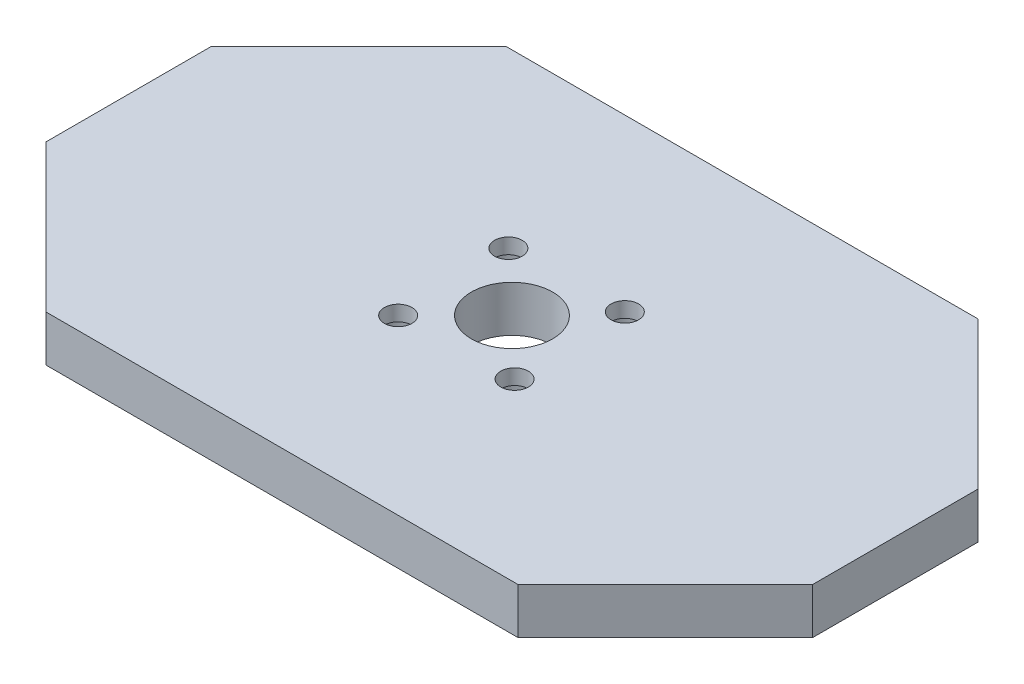
ISO-10303-21;
HEADER;
FILE_DESCRIPTION(('STEP AP214'),'2;1');
FILE_NAME('part.step','',(''),(''),'','','');
FILE_SCHEMA(('AUTOMOTIVE_DESIGN { 1 0 10303 214 1 1 1 1 }'));
ENDSEC;
DATA;
#1=APPLICATION_CONTEXT('core data for automotive mechanical design processes');
#2=APPLICATION_PROTOCOL_DEFINITION('international standard','automotive_design',2000,#1);
#3=PRODUCT_CONTEXT('',#1,'mechanical');
#4=PRODUCT('Part','Part','',(#3));
#5=PRODUCT_RELATED_PRODUCT_CATEGORY('part','',(#4));
#6=PRODUCT_DEFINITION_FORMATION('','',#4);
#7=PRODUCT_DEFINITION_CONTEXT('part definition',#1,'design');
#8=PRODUCT_DEFINITION('design','',#6,#7);
#9=PRODUCT_DEFINITION_SHAPE('','',#8);
#10=(LENGTH_UNIT() NAMED_UNIT(*) SI_UNIT(.MILLI.,.METRE.));
#11=(NAMED_UNIT(*) PLANE_ANGLE_UNIT() SI_UNIT($,.RADIAN.));
#12=(NAMED_UNIT(*) SI_UNIT($,.STERADIAN.) SOLID_ANGLE_UNIT());
#13=UNCERTAINTY_MEASURE_WITH_UNIT(LENGTH_MEASURE(1.E-05),#10,'distance_accuracy_value','');
#14=(GEOMETRIC_REPRESENTATION_CONTEXT(3) GLOBAL_UNCERTAINTY_ASSIGNED_CONTEXT((#13)) GLOBAL_UNIT_ASSIGNED_CONTEXT((#10,
#11,#12)) REPRESENTATION_CONTEXT('',''));
#15=CARTESIAN_POINT('',(0.,0.,0.));
#16=DIRECTION('',(0.,0.,1.));
#17=DIRECTION('',(1.,0.,0.));
#18=AXIS2_PLACEMENT_3D('',#15,#16,#17);
#19=CARTESIAN_POINT('',(-50.,6.,-10.7838723815123));
#20=DIRECTION('',(1.,0.,0.));
#21=DIRECTION('',(0.,0.,-1.));
#22=AXIS2_PLACEMENT_3D('',#19,#20,#21);
#23=PLANE('',#22);
#24=DIRECTION('',(0.,0.,1.));
#25=VECTOR('',#24,1.);
#26=CARTESIAN_POINT('',(-50.,0.,-10.7838723815123));
#27=LINE('',#26,#25);
#28=CARTESIAN_POINT('',(-50.,0.,-10.7838723815123));
#29=VERTEX_POINT('',#28);
#30=CARTESIAN_POINT('',(-50.,0.,10.7838723815123));
#31=VERTEX_POINT('',#30);
#32=EDGE_CURVE('E133',#29,#31,#27,.T.);
#33=ORIENTED_EDGE('',*,*,#32,.T.);
#34=DIRECTION('',(0.,-1.,0.));
#35=VECTOR('',#34,1.);
#36=CARTESIAN_POINT('',(-50.,6.,10.7838723815123));
#37=LINE('',#36,#35);
#38=CARTESIAN_POINT('',(-50.,6.,10.7838723815123));
#39=VERTEX_POINT('',#38);
#40=EDGE_CURVE('E12',#39,#31,#37,.T.);
#41=ORIENTED_EDGE('',*,*,#40,.F.);
#42=DIRECTION('',(0.,0.,1.));
#43=VECTOR('',#42,1.);
#44=CARTESIAN_POINT('',(-50.,6.,-10.7838723815123));
#45=LINE('',#44,#43);
#46=CARTESIAN_POINT('',(-50.,6.,-10.7838723815123));
#47=VERTEX_POINT('',#46);
#48=EDGE_CURVE('E148',#47,#39,#45,.T.);
#49=ORIENTED_EDGE('',*,*,#48,.F.);
#50=DIRECTION('',(0.,-1.,0.));
#51=VECTOR('',#50,1.);
#52=CARTESIAN_POINT('',(-50.,6.,-10.7838723815123));
#53=LINE('',#52,#51);
#54=EDGE_CURVE('E129',#47,#29,#53,.T.);
#55=ORIENTED_EDGE('',*,*,#54,.T.);
#56=EDGE_LOOP('',(#33,#41,#49,#55));
#57=FACE_BOUND('',#56,.T.);
#58=ADVANCED_FACE('F35',(#57),#23,.F.);
#59=CARTESIAN_POINT('',(-50.,6.,10.7838723815123));
#60=DIRECTION('',(0.707106781186551,0.,-0.707106781186544));
#61=DIRECTION('',(-0.707106781186544,0.,-0.707106781186551));
#62=AXIS2_PLACEMENT_3D('',#59,#60,#61);
#63=PLANE('',#62);
#64=DIRECTION('',(0.707106781186544,0.,0.707106781186551));
#65=VECTOR('',#64,1.);
#66=CARTESIAN_POINT('',(-50.,0.,10.7838723815123));
#67=LINE('',#66,#65);
#68=CARTESIAN_POINT('',(-30.7838723815125,0.,30.));
#69=VERTEX_POINT('',#68);
#70=EDGE_CURVE('E136',#31,#69,#67,.T.);
#71=ORIENTED_EDGE('',*,*,#70,.T.);
#72=DIRECTION('',(0.,-1.,0.));
#73=VECTOR('',#72,1.);
#74=CARTESIAN_POINT('',(-30.7838723815125,6.,30.));
#75=LINE('',#74,#73);
#76=CARTESIAN_POINT('',(-30.7838723815125,6.,30.));
#77=VERTEX_POINT('',#76);
#78=EDGE_CURVE('E44',#77,#69,#75,.T.);
#79=ORIENTED_EDGE('',*,*,#78,.F.);
#80=DIRECTION('',(0.707106781186544,0.,0.707106781186551));
#81=VECTOR('',#80,1.);
#82=CARTESIAN_POINT('',(-50.,6.,10.7838723815123));
#83=LINE('',#82,#81);
#84=EDGE_CURVE('E96',#39,#77,#83,.T.);
#85=ORIENTED_EDGE('',*,*,#84,.F.);
#86=ORIENTED_EDGE('',*,*,#40,.T.);
#87=EDGE_LOOP('',(#71,#79,#85,#86));
#88=FACE_BOUND('',#87,.T.);
#89=ADVANCED_FACE('F242',(#88),#63,.F.);
#90=CARTESIAN_POINT('',(-30.7838723815125,6.,30.));
#91=DIRECTION('',(0.,0.,-1.));
#92=DIRECTION('',(-1.,0.,0.));
#93=AXIS2_PLACEMENT_3D('',#90,#91,#92);
#94=PLANE('',#93);
#95=DIRECTION('',(1.,0.,0.));
#96=VECTOR('',#95,1.);
#97=CARTESIAN_POINT('',(-30.7838723815125,0.,30.));
#98=LINE('',#97,#96);
#99=CARTESIAN_POINT('',(30.7838723815125,0.,30.));
#100=VERTEX_POINT('',#99);
#101=EDGE_CURVE('E139',#69,#100,#98,.T.);
#102=ORIENTED_EDGE('',*,*,#101,.T.);
#103=DIRECTION('',(0.,-1.,0.));
#104=VECTOR('',#103,1.);
#105=CARTESIAN_POINT('',(30.7838723815125,6.,30.));
#106=LINE('',#105,#104);
#107=CARTESIAN_POINT('',(30.7838723815125,6.,30.));
#108=VERTEX_POINT('',#107);
#109=EDGE_CURVE('E155',#108,#100,#106,.T.);
#110=ORIENTED_EDGE('',*,*,#109,.F.);
#111=DIRECTION('',(1.,0.,0.));
#112=VECTOR('',#111,1.);
#113=CARTESIAN_POINT('',(-30.7838723815125,6.,30.));
#114=LINE('',#113,#112);
#115=EDGE_CURVE('E210',#77,#108,#114,.T.);
#116=ORIENTED_EDGE('',*,*,#115,.F.);
#117=ORIENTED_EDGE('',*,*,#78,.T.);
#118=EDGE_LOOP('',(#102,#110,#116,#117));
#119=FACE_BOUND('',#118,.T.);
#120=ADVANCED_FACE('F246',(#119),#94,.F.);
#121=CARTESIAN_POINT('',(50.,6.,10.7838723815123));
#122=DIRECTION('',(-0.707106781186551,0.,-0.707106781186544));
#123=DIRECTION('',(-0.707106781186544,0.,0.707106781186551));
#124=AXIS2_PLACEMENT_3D('',#121,#122,#123);
#125=PLANE('',#124);
#126=DIRECTION('',(0.707106781186544,0.,-0.707106781186551));
#127=VECTOR('',#126,1.);
#128=CARTESIAN_POINT('',(50.,0.,10.7838723815123));
#129=LINE('',#128,#127);
#130=CARTESIAN_POINT('',(50.,0.,10.7838723815123));
#131=VERTEX_POINT('',#130);
#132=EDGE_CURVE('E141',#100,#131,#129,.T.);
#133=ORIENTED_EDGE('',*,*,#132,.T.);
#134=DIRECTION('',(0.,-1.,0.));
#135=VECTOR('',#134,1.);
#136=CARTESIAN_POINT('',(50.,6.,10.7838723815123));
#137=LINE('',#136,#135);
#138=CARTESIAN_POINT('',(50.,6.,10.7838723815123));
#139=VERTEX_POINT('',#138);
#140=EDGE_CURVE('E152',#139,#131,#137,.T.);
#141=ORIENTED_EDGE('',*,*,#140,.F.);
#142=DIRECTION('',(0.707106781186544,0.,-0.707106781186551));
#143=VECTOR('',#142,1.);
#144=CARTESIAN_POINT('',(50.,6.,10.7838723815123));
#145=LINE('',#144,#143);
#146=EDGE_CURVE('E212',#108,#139,#145,.T.);
#147=ORIENTED_EDGE('',*,*,#146,.F.);
#148=ORIENTED_EDGE('',*,*,#109,.T.);
#149=EDGE_LOOP('',(#133,#141,#147,#148));
#150=FACE_BOUND('',#149,.T.);
#151=ADVANCED_FACE('F218',(#150),#125,.F.);
#152=CARTESIAN_POINT('',(50.,6.,-10.7838723815124));
#153=DIRECTION('',(-1.,0.,0.));
#154=DIRECTION('',(0.,0.,1.));
#155=AXIS2_PLACEMENT_3D('',#152,#153,#154);
#156=PLANE('',#155);
#157=DIRECTION('',(0.,0.,-1.));
#158=VECTOR('',#157,1.);
#159=CARTESIAN_POINT('',(50.,0.,-10.7838723815124));
#160=LINE('',#159,#158);
#161=CARTESIAN_POINT('',(50.,0.,-10.7838723815124));
#162=VERTEX_POINT('',#161);
#163=EDGE_CURVE('E143',#131,#162,#160,.T.);
#164=ORIENTED_EDGE('',*,*,#163,.T.);
#165=DIRECTION('',(0.,-1.,0.));
#166=VECTOR('',#165,1.);
#167=CARTESIAN_POINT('',(50.,6.,-10.7838723815124));
#168=LINE('',#167,#166);
#169=CARTESIAN_POINT('',(50.,6.,-10.7838723815124));
#170=VERTEX_POINT('',#169);
#171=EDGE_CURVE('E124',#170,#162,#168,.T.);
#172=ORIENTED_EDGE('',*,*,#171,.F.);
#173=DIRECTION('',(0.,0.,-1.));
#174=VECTOR('',#173,1.);
#175=CARTESIAN_POINT('',(50.,6.,-10.7838723815124));
#176=LINE('',#175,#174);
#177=EDGE_CURVE('E115',#139,#170,#176,.T.);
#178=ORIENTED_EDGE('',*,*,#177,.F.);
#179=ORIENTED_EDGE('',*,*,#140,.T.);
#180=EDGE_LOOP('',(#164,#172,#178,#179));
#181=FACE_BOUND('',#180,.T.);
#182=ADVANCED_FACE('F222',(#181),#156,.F.);
#183=CARTESIAN_POINT('',(30.7838723815125,6.,-30.));
#184=DIRECTION('',(-0.70710678118655,0.,0.707106781186545));
#185=DIRECTION('',(0.707106781186545,0.,0.70710678118655));
#186=AXIS2_PLACEMENT_3D('',#183,#184,#185);
#187=PLANE('',#186);
#188=DIRECTION('',(-0.707106781186545,0.,-0.70710678118655));
#189=VECTOR('',#188,1.);
#190=CARTESIAN_POINT('',(30.7838723815125,0.,-30.));
#191=LINE('',#190,#189);
#192=CARTESIAN_POINT('',(30.7838723815125,0.,-30.));
#193=VERTEX_POINT('',#192);
#194=EDGE_CURVE('E123',#162,#193,#191,.T.);
#195=ORIENTED_EDGE('',*,*,#194,.T.);
#196=DIRECTION('',(0.,-1.,0.));
#197=VECTOR('',#196,1.);
#198=CARTESIAN_POINT('',(30.7838723815125,6.,-30.));
#199=LINE('',#198,#197);
#200=CARTESIAN_POINT('',(30.7838723815125,6.,-30.));
#201=VERTEX_POINT('',#200);
#202=EDGE_CURVE('E120',#201,#193,#199,.T.);
#203=ORIENTED_EDGE('',*,*,#202,.F.);
#204=DIRECTION('',(-0.707106781186545,0.,-0.70710678118655));
#205=VECTOR('',#204,1.);
#206=CARTESIAN_POINT('',(30.7838723815125,6.,-30.));
#207=LINE('',#206,#205);
#208=EDGE_CURVE('E109',#170,#201,#207,.T.);
#209=ORIENTED_EDGE('',*,*,#208,.F.);
#210=ORIENTED_EDGE('',*,*,#171,.T.);
#211=EDGE_LOOP('',(#195,#203,#209,#210));
#212=FACE_BOUND('',#211,.T.);
#213=ADVANCED_FACE('F121',(#212),#187,.F.);
#214=CARTESIAN_POINT('',(-30.7838723815125,6.,-30.));
#215=DIRECTION('',(0.,0.,1.));
#216=DIRECTION('',(1.,0.,0.));
#217=AXIS2_PLACEMENT_3D('',#214,#215,#216);
#218=PLANE('',#217);
#219=DIRECTION('',(-1.,0.,0.));
#220=VECTOR('',#219,1.);
#221=CARTESIAN_POINT('',(-30.7838723815125,0.,-30.));
#222=LINE('',#221,#220);
#223=CARTESIAN_POINT('',(-30.7838723815125,0.,-30.));
#224=VERTEX_POINT('',#223);
#225=EDGE_CURVE('E82',#193,#224,#222,.T.);
#226=ORIENTED_EDGE('',*,*,#225,.T.);
#227=DIRECTION('',(0.,-1.,0.));
#228=VECTOR('',#227,1.);
#229=CARTESIAN_POINT('',(-30.7838723815125,6.,-30.));
#230=LINE('',#229,#228);
#231=CARTESIAN_POINT('',(-30.7838723815125,6.,-30.));
#232=VERTEX_POINT('',#231);
#233=EDGE_CURVE('E125',#232,#224,#230,.T.);
#234=ORIENTED_EDGE('',*,*,#233,.F.);
#235=DIRECTION('',(-1.,0.,0.));
#236=VECTOR('',#235,1.);
#237=CARTESIAN_POINT('',(-30.7838723815125,6.,-30.));
#238=LINE('',#237,#236);
#239=EDGE_CURVE('E113',#201,#232,#238,.T.);
#240=ORIENTED_EDGE('',*,*,#239,.F.);
#241=ORIENTED_EDGE('',*,*,#202,.T.);
#242=EDGE_LOOP('',(#226,#234,#240,#241));
#243=FACE_BOUND('',#242,.T.);
#244=ADVANCED_FACE('F127',(#243),#218,.F.);
#245=CARTESIAN_POINT('',(-50.,6.,-10.7838723815123));
#246=DIRECTION('',(0.707106781186551,0.,0.707106781186544));
#247=DIRECTION('',(0.707106781186544,0.,-0.707106781186551));
#248=AXIS2_PLACEMENT_3D('',#245,#246,#247);
#249=PLANE('',#248);
#250=DIRECTION('',(-0.707106781186544,0.,0.707106781186551));
#251=VECTOR('',#250,1.);
#252=CARTESIAN_POINT('',(-50.,0.,-10.7838723815123));
#253=LINE('',#252,#251);
#254=EDGE_CURVE('E88',#224,#29,#253,.T.);
#255=ORIENTED_EDGE('',*,*,#254,.T.);
#256=ORIENTED_EDGE('',*,*,#54,.F.);
#257=DIRECTION('',(-0.707106781186544,0.,0.707106781186551));
#258=VECTOR('',#257,1.);
#259=CARTESIAN_POINT('',(-50.,6.,-10.7838723815123));
#260=LINE('',#259,#258);
#261=EDGE_CURVE('E53',#232,#47,#260,.T.);
#262=ORIENTED_EDGE('',*,*,#261,.F.);
#263=ORIENTED_EDGE('',*,*,#233,.T.);
#264=EDGE_LOOP('',(#255,#256,#262,#263));
#265=FACE_BOUND('',#264,.T.);
#266=ADVANCED_FACE('F230',(#265),#249,.F.);
#267=CARTESIAN_POINT('',(0.,6.,0.));
#268=DIRECTION('',(0.,1.,0.));
#269=DIRECTION('',(0.,0.,1.));
#270=AXIS2_PLACEMENT_3D('',#267,#268,#269);
#271=PLANE('',#270);
#272=CARTESIAN_POINT('',(7.35742289816454,6.,7.02150900667103));
#273=DIRECTION('',(0.,1.,0.));
#274=DIRECTION('',(0.,0.,1.));
#275=AXIS2_PLACEMENT_3D('',#272,#273,#274);
#276=CIRCLE('',#275,1.8);
#277=CARTESIAN_POINT('',(7.35742289816454,6.,8.82150900667103));
#278=VERTEX_POINT('',#277);
#279=EDGE_CURVE('E163',#278,#278,#276,.T.);
#280=ORIENTED_EDGE('',*,*,#279,.F.);
#281=EDGE_LOOP('',(#280));
#282=FACE_BOUND('',#281,.T.);
#283=CARTESIAN_POINT('',(6.95431070237677,6.,-7.76053509395223));
#284=DIRECTION('',(0.,1.,0.));
#285=DIRECTION('',(0.,0.,1.));
#286=AXIS2_PLACEMENT_3D('',#283,#284,#285);
#287=CIRCLE('',#286,1.8);
#288=CARTESIAN_POINT('',(6.95431070237677,6.,-5.96053509395223));
#289=VERTEX_POINT('',#288);
#290=EDGE_CURVE('E194',#289,#289,#287,.T.);
#291=ORIENTED_EDGE('',*,*,#290,.F.);
#292=EDGE_LOOP('',(#291));
#293=FACE_BOUND('',#292,.T.);
#294=CARTESIAN_POINT('',(-7.8277333982465,6.,-7.35742289816445));
#295=DIRECTION('',(0.,1.,0.));
#296=DIRECTION('',(0.,0.,1.));
#297=AXIS2_PLACEMENT_3D('',#294,#295,#296);
#298=CIRCLE('',#297,1.8);
#299=CARTESIAN_POINT('',(-7.8277333982465,6.,-5.55742289816445));
#300=VERTEX_POINT('',#299);
#301=EDGE_CURVE('E197',#300,#300,#298,.T.);
#302=ORIENTED_EDGE('',*,*,#301,.F.);
#303=EDGE_LOOP('',(#302));
#304=FACE_BOUND('',#303,.T.);
#305=CARTESIAN_POINT('',(-7.42462120245872,6.,7.42462120245881));
#306=DIRECTION('',(0.,1.,0.));
#307=DIRECTION('',(0.,0.,1.));
#308=AXIS2_PLACEMENT_3D('',#305,#306,#307);
#309=CIRCLE('',#308,1.8);
#310=CARTESIAN_POINT('',(-7.42462120245872,6.,9.22462120245881));
#311=VERTEX_POINT('',#310);
#312=EDGE_CURVE('E200',#311,#311,#309,.T.);
#313=ORIENTED_EDGE('',*,*,#312,.F.);
#314=EDGE_LOOP('',(#313));
#315=FACE_BOUND('',#314,.T.);
#316=CARTESIAN_POINT('',(0.,6.,0.));
#317=DIRECTION('',(0.,1.,0.));
#318=DIRECTION('',(0.,0.,1.));
#319=AXIS2_PLACEMENT_3D('',#316,#317,#318);
#320=CIRCLE('',#319,5.3);
#321=CARTESIAN_POINT('',(0.,6.,5.30000000000005));
#322=VERTEX_POINT('',#321);
#323=EDGE_CURVE('E203',#322,#322,#320,.T.);
#324=ORIENTED_EDGE('',*,*,#323,.F.);
#325=EDGE_LOOP('',(#324));
#326=FACE_BOUND('',#325,.T.);
#327=ORIENTED_EDGE('',*,*,#48,.T.);
#328=ORIENTED_EDGE('',*,*,#84,.T.);
#329=ORIENTED_EDGE('',*,*,#115,.T.);
#330=ORIENTED_EDGE('',*,*,#146,.T.);
#331=ORIENTED_EDGE('',*,*,#177,.T.);
#332=ORIENTED_EDGE('',*,*,#208,.T.);
#333=ORIENTED_EDGE('',*,*,#239,.T.);
#334=ORIENTED_EDGE('',*,*,#261,.T.);
#335=EDGE_LOOP('',(#327,#328,#329,#330,#331,#332,#333,#334));
#336=FACE_BOUND('',#335,.T.);
#337=ADVANCED_FACE('F111',(#282,#293,#304,#315,#326,#336),#271,.T.);
#338=CARTESIAN_POINT('',(0.,0.,0.));
#339=DIRECTION('',(0.,1.,0.));
#340=DIRECTION('',(0.,0.,1.));
#341=AXIS2_PLACEMENT_3D('',#338,#339,#340);
#342=PLANE('',#341);
#343=CARTESIAN_POINT('',(-7.8277333982465,0.,-7.35742289816445));
#344=DIRECTION('',(0.,-1.,0.));
#345=DIRECTION('',(0.,0.,-1.));
#346=AXIS2_PLACEMENT_3D('',#343,#344,#345);
#347=CIRCLE('',#346,4.);
#348=CARTESIAN_POINT('',(-7.8277333982465,0.,-11.3574228981645));
#349=VERTEX_POINT('',#348);
#350=EDGE_CURVE('E419',#349,#349,#347,.T.);
#351=ORIENTED_EDGE('',*,*,#350,.F.);
#352=EDGE_LOOP('',(#351));
#353=FACE_BOUND('',#352,.T.);
#354=CARTESIAN_POINT('',(-7.42462120245872,0.,7.42462120245881));
#355=DIRECTION('',(0.,-1.,0.));
#356=DIRECTION('',(0.,0.,-1.));
#357=AXIS2_PLACEMENT_3D('',#354,#355,#356);
#358=CIRCLE('',#357,2.97880361974779);
#359=CARTESIAN_POINT('',(-7.42462120245872,0.,4.44581758271102));
#360=VERTEX_POINT('',#359);
#361=EDGE_CURVE('E178',#360,#360,#358,.T.);
#362=ORIENTED_EDGE('',*,*,#361,.F.);
#363=EDGE_LOOP('',(#362));
#364=FACE_BOUND('',#363,.T.);
#365=CARTESIAN_POINT('',(6.95431070237677,0.,-7.76053509395223));
#366=DIRECTION('',(0.,-1.,0.));
#367=DIRECTION('',(0.,0.,-1.));
#368=AXIS2_PLACEMENT_3D('',#365,#366,#367);
#369=CIRCLE('',#368,2.91088315066456);
#370=CARTESIAN_POINT('',(6.95431070237677,0.,-10.6714182446168));
#371=VERTEX_POINT('',#370);
#372=EDGE_CURVE('E171',#371,#371,#369,.T.);
#373=ORIENTED_EDGE('',*,*,#372,.F.);
#374=EDGE_LOOP('',(#373));
#375=FACE_BOUND('',#374,.T.);
#376=CARTESIAN_POINT('',(7.35742289816454,0.,7.02150900667103));
#377=DIRECTION('',(0.,-1.,0.));
#378=DIRECTION('',(0.,0.,-1.));
#379=AXIS2_PLACEMENT_3D('',#376,#377,#378);
#380=CIRCLE('',#379,4.);
#381=CARTESIAN_POINT('',(7.35742289816454,0.,3.02150900667103));
#382=VERTEX_POINT('',#381);
#383=EDGE_CURVE('E167',#382,#382,#380,.T.);
#384=ORIENTED_EDGE('',*,*,#383,.F.);
#385=EDGE_LOOP('',(#384));
#386=FACE_BOUND('',#385,.T.);
#387=CARTESIAN_POINT('',(0.,0.,0.));
#388=DIRECTION('',(0.,1.,0.));
#389=DIRECTION('',(0.,0.,1.));
#390=AXIS2_PLACEMENT_3D('',#387,#388,#389);
#391=CIRCLE('',#390,5.3);
#392=CARTESIAN_POINT('',(0.,0.,5.30000000000005));
#393=VERTEX_POINT('',#392);
#394=EDGE_CURVE('E137',#393,#393,#391,.F.);
#395=ORIENTED_EDGE('',*,*,#394,.F.);
#396=EDGE_LOOP('',(#395));
#397=FACE_BOUND('',#396,.T.);
#398=ORIENTED_EDGE('',*,*,#32,.F.);
#399=ORIENTED_EDGE('',*,*,#254,.F.);
#400=ORIENTED_EDGE('',*,*,#225,.F.);
#401=ORIENTED_EDGE('',*,*,#194,.F.);
#402=ORIENTED_EDGE('',*,*,#163,.F.);
#403=ORIENTED_EDGE('',*,*,#132,.F.);
#404=ORIENTED_EDGE('',*,*,#101,.F.);
#405=ORIENTED_EDGE('',*,*,#70,.F.);
#406=EDGE_LOOP('',(#398,#399,#400,#401,#402,#403,#404,#405));
#407=FACE_BOUND('',#406,.T.);
#408=ADVANCED_FACE('F225',(#353,#364,#375,#386,#397,#407),#342,.F.);
#409=CARTESIAN_POINT('',(0.,-0.00100000000000013,0.));
#410=DIRECTION('',(0.,1.,0.));
#411=DIRECTION('',(0.,0.,1.));
#412=AXIS2_PLACEMENT_3D('',#409,#410,#411);
#413=CYLINDRICAL_SURFACE('',#412,5.3);
#414=ORIENTED_EDGE('',*,*,#323,.T.);
#415=EDGE_LOOP('',(#414));
#416=FACE_BOUND('',#415,.T.);
#417=ORIENTED_EDGE('',*,*,#394,.T.);
#418=EDGE_LOOP('',(#417));
#419=FACE_BOUND('',#418,.T.);
#420=ADVANCED_FACE('F283',(#416,#419),#413,.F.);
#421=CARTESIAN_POINT('',(-7.42462120245872,-0.00100000000000013,7.42462120245881));
#422=DIRECTION('',(0.,1.,0.));
#423=DIRECTION('',(0.,0.,1.));
#424=AXIS2_PLACEMENT_3D('',#421,#422,#423);
#425=CYLINDRICAL_SURFACE('',#424,1.8);
#426=CARTESIAN_POINT('',(-7.42462120245872,4.,7.42462120245881));
#427=DIRECTION('',(0.,1.,0.));
#428=DIRECTION('',(0.,0.,1.));
#429=AXIS2_PLACEMENT_3D('',#426,#427,#428);
#430=CIRCLE('',#429,1.8);
#431=CARTESIAN_POINT('',(-7.42462120245872,4.,9.22462120245881));
#432=VERTEX_POINT('',#431);
#433=EDGE_CURVE('E169',#432,#432,#430,.F.);
#434=ORIENTED_EDGE('',*,*,#433,.T.);
#435=EDGE_LOOP('',(#434));
#436=FACE_BOUND('',#435,.T.);
#437=ORIENTED_EDGE('',*,*,#312,.T.);
#438=EDGE_LOOP('',(#437));
#439=FACE_BOUND('',#438,.T.);
#440=ADVANCED_FACE('F288',(#436,#439),#425,.F.);
#441=CARTESIAN_POINT('',(-7.8277333982465,-0.00100000000000013,-7.35742289816445));
#442=DIRECTION('',(0.,1.,0.));
#443=DIRECTION('',(0.,0.,1.));
#444=AXIS2_PLACEMENT_3D('',#441,#442,#443);
#445=CYLINDRICAL_SURFACE('',#444,1.8);
#446=CARTESIAN_POINT('',(-7.8277333982465,4.,-7.35742289816445));
#447=DIRECTION('',(0.,1.,0.));
#448=DIRECTION('',(0.,0.,1.));
#449=AXIS2_PLACEMENT_3D('',#446,#447,#448);
#450=CIRCLE('',#449,1.8);
#451=CARTESIAN_POINT('',(-7.8277333982465,4.,-5.55742289816445));
#452=VERTEX_POINT('',#451);
#453=EDGE_CURVE('E38',#452,#452,#450,.F.);
#454=ORIENTED_EDGE('',*,*,#453,.T.);
#455=EDGE_LOOP('',(#454));
#456=FACE_BOUND('',#455,.T.);
#457=ORIENTED_EDGE('',*,*,#301,.T.);
#458=EDGE_LOOP('',(#457));
#459=FACE_BOUND('',#458,.T.);
#460=ADVANCED_FACE('F304',(#456,#459),#445,.F.);
#461=CARTESIAN_POINT('',(6.95431070237677,-0.00100000000000013,-7.76053509395223));
#462=DIRECTION('',(0.,1.,0.));
#463=DIRECTION('',(0.,0.,1.));
#464=AXIS2_PLACEMENT_3D('',#461,#462,#463);
#465=CYLINDRICAL_SURFACE('',#464,1.8);
#466=CARTESIAN_POINT('',(6.95431070237677,4.,-7.76053509395223));
#467=DIRECTION('',(0.,1.,0.));
#468=DIRECTION('',(0.,0.,1.));
#469=AXIS2_PLACEMENT_3D('',#466,#467,#468);
#470=CIRCLE('',#469,1.8);
#471=CARTESIAN_POINT('',(6.95431070237677,4.,-5.96053509395223));
#472=VERTEX_POINT('',#471);
#473=EDGE_CURVE('E165',#472,#472,#470,.F.);
#474=ORIENTED_EDGE('',*,*,#473,.T.);
#475=EDGE_LOOP('',(#474));
#476=FACE_BOUND('',#475,.T.);
#477=ORIENTED_EDGE('',*,*,#290,.T.);
#478=EDGE_LOOP('',(#477));
#479=FACE_BOUND('',#478,.T.);
#480=ADVANCED_FACE('F313',(#476,#479),#465,.F.);
#481=CARTESIAN_POINT('',(7.35742289816454,-0.00100000000000013,7.02150900667103));
#482=DIRECTION('',(0.,1.,0.));
#483=DIRECTION('',(0.,0.,1.));
#484=AXIS2_PLACEMENT_3D('',#481,#482,#483);
#485=CYLINDRICAL_SURFACE('',#484,1.8);
#486=CARTESIAN_POINT('',(7.35742289816454,4.,7.02150900667103));
#487=DIRECTION('',(0.,1.,0.));
#488=DIRECTION('',(0.,0.,1.));
#489=AXIS2_PLACEMENT_3D('',#486,#487,#488);
#490=CIRCLE('',#489,1.8);
#491=CARTESIAN_POINT('',(7.35742289816454,4.,8.82150900667103));
#492=VERTEX_POINT('',#491);
#493=EDGE_CURVE('E160',#492,#492,#490,.F.);
#494=ORIENTED_EDGE('',*,*,#493,.T.);
#495=EDGE_LOOP('',(#494));
#496=FACE_BOUND('',#495,.T.);
#497=ORIENTED_EDGE('',*,*,#279,.T.);
#498=EDGE_LOOP('',(#497));
#499=FACE_BOUND('',#498,.T.);
#500=ADVANCED_FACE('F323',(#496,#499),#485,.F.);
#501=CARTESIAN_POINT('',(0.,4.,0.));
#502=DIRECTION('',(0.,1.,0.));
#503=DIRECTION('',(0.,0.,1.));
#504=AXIS2_PLACEMENT_3D('',#501,#502,#503);
#505=PLANE('',#504);
#506=CARTESIAN_POINT('',(7.35742289816454,4.,7.02150900667103));
#507=DIRECTION('',(0.,1.,0.));
#508=DIRECTION('',(0.,0.,1.));
#509=AXIS2_PLACEMENT_3D('',#506,#507,#508);
#510=CIRCLE('',#509,4.);
#511=CARTESIAN_POINT('',(7.35742289816454,4.,11.021509006671));
#512=VERTEX_POINT('',#511);
#513=EDGE_CURVE('E164',#512,#512,#510,.F.);
#514=ORIENTED_EDGE('',*,*,#513,.T.);
#515=EDGE_LOOP('',(#514));
#516=FACE_BOUND('',#515,.T.);
#517=ORIENTED_EDGE('',*,*,#493,.F.);
#518=EDGE_LOOP('',(#517));
#519=FACE_BOUND('',#518,.T.);
#520=ADVANCED_FACE('F333',(#516,#519),#505,.F.);
#521=CARTESIAN_POINT('',(7.35742289816454,17.3137084989848,7.02150900667103));
#522=DIRECTION('',(0.,-1.,0.));
#523=DIRECTION('',(0.,0.,-1.));
#524=AXIS2_PLACEMENT_3D('',#521,#522,#523);
#525=CYLINDRICAL_SURFACE('',#524,4.);
#526=ORIENTED_EDGE('',*,*,#383,.T.);
#527=EDGE_LOOP('',(#526));
#528=FACE_BOUND('',#527,.T.);
#529=ORIENTED_EDGE('',*,*,#513,.F.);
#530=EDGE_LOOP('',(#529));
#531=FACE_BOUND('',#530,.T.);
#532=ADVANCED_FACE('F343',(#528,#531),#525,.F.);
#533=CARTESIAN_POINT('',(0.,4.,0.));
#534=DIRECTION('',(0.,1.,0.));
#535=DIRECTION('',(0.,0.,1.));
#536=AXIS2_PLACEMENT_3D('',#533,#534,#535);
#537=PLANE('',#536);
#538=CARTESIAN_POINT('',(6.95431070237677,4.,-7.76053509395223));
#539=DIRECTION('',(0.,1.,0.));
#540=DIRECTION('',(0.,0.,1.));
#541=AXIS2_PLACEMENT_3D('',#538,#539,#540);
#542=CIRCLE('',#541,2.91088315066456);
#543=CARTESIAN_POINT('',(6.95431070237677,4.,-4.84965194328766));
#544=VERTEX_POINT('',#543);
#545=EDGE_CURVE('E168',#544,#544,#542,.F.);
#546=ORIENTED_EDGE('',*,*,#545,.T.);
#547=EDGE_LOOP('',(#546));
#548=FACE_BOUND('',#547,.T.);
#549=ORIENTED_EDGE('',*,*,#473,.F.);
#550=EDGE_LOOP('',(#549));
#551=FACE_BOUND('',#550,.T.);
#552=ADVANCED_FACE('F353',(#548,#551),#537,.F.);
#553=CARTESIAN_POINT('',(6.95431070237677,17.3137084989848,-7.76053509395223));
#554=DIRECTION('',(0.,-1.,0.));
#555=DIRECTION('',(0.,0.,-1.));
#556=AXIS2_PLACEMENT_3D('',#553,#554,#555);
#557=CYLINDRICAL_SURFACE('',#556,2.91088315066456);
#558=ORIENTED_EDGE('',*,*,#372,.T.);
#559=EDGE_LOOP('',(#558));
#560=FACE_BOUND('',#559,.T.);
#561=ORIENTED_EDGE('',*,*,#545,.F.);
#562=EDGE_LOOP('',(#561));
#563=FACE_BOUND('',#562,.T.);
#564=ADVANCED_FACE('F363',(#560,#563),#557,.F.);
#565=CARTESIAN_POINT('',(0.,4.,0.));
#566=DIRECTION('',(0.,1.,0.));
#567=DIRECTION('',(0.,0.,1.));
#568=AXIS2_PLACEMENT_3D('',#565,#566,#567);
#569=PLANE('',#568);
#570=CARTESIAN_POINT('',(-7.42462120245872,4.,7.42462120245881));
#571=DIRECTION('',(0.,1.,0.));
#572=DIRECTION('',(0.,0.,1.));
#573=AXIS2_PLACEMENT_3D('',#570,#571,#572);
#574=CIRCLE('',#573,2.97880361974779);
#575=CARTESIAN_POINT('',(-7.42462120245872,4.,10.4034248222066));
#576=VERTEX_POINT('',#575);
#577=EDGE_CURVE('E172',#576,#576,#574,.F.);
#578=ORIENTED_EDGE('',*,*,#577,.T.);
#579=EDGE_LOOP('',(#578));
#580=FACE_BOUND('',#579,.T.);
#581=ORIENTED_EDGE('',*,*,#433,.F.);
#582=EDGE_LOOP('',(#581));
#583=FACE_BOUND('',#582,.T.);
#584=ADVANCED_FACE('F373',(#580,#583),#569,.F.);
#585=CARTESIAN_POINT('',(-7.42462120245872,17.3137084989848,7.42462120245881));
#586=DIRECTION('',(0.,-1.,0.));
#587=DIRECTION('',(0.,0.,-1.));
#588=AXIS2_PLACEMENT_3D('',#585,#586,#587);
#589=CYLINDRICAL_SURFACE('',#588,2.97880361974779);
#590=ORIENTED_EDGE('',*,*,#361,.T.);
#591=EDGE_LOOP('',(#590));
#592=FACE_BOUND('',#591,.T.);
#593=ORIENTED_EDGE('',*,*,#577,.F.);
#594=EDGE_LOOP('',(#593));
#595=FACE_BOUND('',#594,.T.);
#596=ADVANCED_FACE('F383',(#592,#595),#589,.F.);
#597=CARTESIAN_POINT('',(0.,4.,0.));
#598=DIRECTION('',(0.,1.,0.));
#599=DIRECTION('',(0.,0.,1.));
#600=AXIS2_PLACEMENT_3D('',#597,#598,#599);
#601=PLANE('',#600);
#602=CARTESIAN_POINT('',(-7.8277333982465,4.,-7.35742289816445));
#603=DIRECTION('',(0.,1.,0.));
#604=DIRECTION('',(0.,0.,1.));
#605=AXIS2_PLACEMENT_3D('',#602,#603,#604);
#606=CIRCLE('',#605,4.);
#607=CARTESIAN_POINT('',(-7.8277333982465,4.,-3.35742289816445));
#608=VERTEX_POINT('',#607);
#609=EDGE_CURVE('E422',#608,#608,#606,.F.);
#610=ORIENTED_EDGE('',*,*,#609,.T.);
#611=EDGE_LOOP('',(#610));
#612=FACE_BOUND('',#611,.T.);
#613=ORIENTED_EDGE('',*,*,#453,.F.);
#614=EDGE_LOOP('',(#613));
#615=FACE_BOUND('',#614,.T.);
#616=ADVANCED_FACE('F392',(#612,#615),#601,.F.);
#617=CARTESIAN_POINT('',(-7.8277333982465,17.3137084989848,-7.35742289816445));
#618=DIRECTION('',(0.,-1.,0.));
#619=DIRECTION('',(0.,0.,-1.));
#620=AXIS2_PLACEMENT_3D('',#617,#618,#619);
#621=CYLINDRICAL_SURFACE('',#620,4.);
#622=ORIENTED_EDGE('',*,*,#350,.T.);
#623=EDGE_LOOP('',(#622));
#624=FACE_BOUND('',#623,.T.);
#625=ORIENTED_EDGE('',*,*,#609,.F.);
#626=EDGE_LOOP('',(#625));
#627=FACE_BOUND('',#626,.T.);
#628=ADVANCED_FACE('F402',(#624,#627),#621,.F.);
#629=CLOSED_SHELL('',(#58,#89,#120,#151,#182,#213,#244,#266,#337,#408,#420,#440,#460,#480,#500,
#520,#532,#552,#564,#584,#596,#616,#628));
#630=MANIFOLD_SOLID_BREP('B2',#629);
#631=ADVANCED_BREP_SHAPE_REPRESENTATION('',(#18,#630),#14);
#632=SHAPE_DEFINITION_REPRESENTATION(#9,#631);
ENDSEC;
END-ISO-10303-21;
